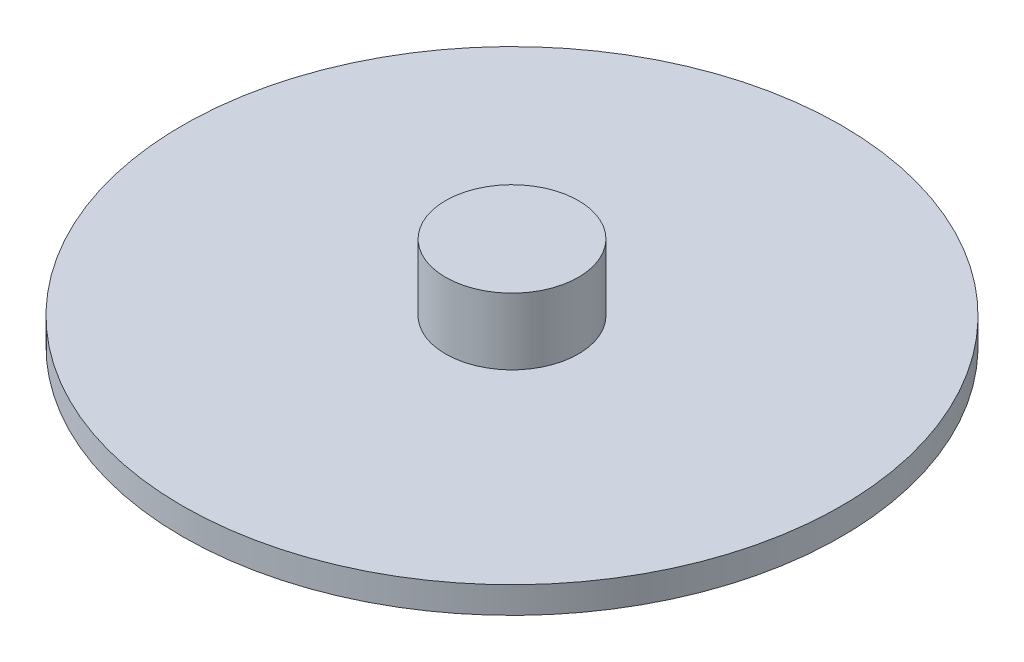
ISO-10303-21;
HEADER;
FILE_DESCRIPTION(('STEP AP214'),'2;1');
FILE_NAME('part.step','',(''),(''),'','','');
FILE_SCHEMA(('AUTOMOTIVE_DESIGN { 1 0 10303 214 1 1 1 1 }'));
ENDSEC;
DATA;
#1=APPLICATION_CONTEXT('core data for automotive mechanical design processes');
#2=APPLICATION_PROTOCOL_DEFINITION('international standard','automotive_design',2000,#1);
#3=PRODUCT_CONTEXT('',#1,'mechanical');
#4=PRODUCT('Part','Part','',(#3));
#5=PRODUCT_RELATED_PRODUCT_CATEGORY('part','',(#4));
#6=PRODUCT_DEFINITION_FORMATION('','',#4);
#7=PRODUCT_DEFINITION_CONTEXT('part definition',#1,'design');
#8=PRODUCT_DEFINITION('design','',#6,#7);
#9=PRODUCT_DEFINITION_SHAPE('','',#8);
#10=(LENGTH_UNIT() NAMED_UNIT(*) SI_UNIT(.MILLI.,.METRE.));
#11=(NAMED_UNIT(*) PLANE_ANGLE_UNIT() SI_UNIT($,.RADIAN.));
#12=(NAMED_UNIT(*) SI_UNIT($,.STERADIAN.) SOLID_ANGLE_UNIT());
#13=UNCERTAINTY_MEASURE_WITH_UNIT(LENGTH_MEASURE(1.E-05),#10,'distance_accuracy_value','');
#14=(GEOMETRIC_REPRESENTATION_CONTEXT(3) GLOBAL_UNCERTAINTY_ASSIGNED_CONTEXT((#13)) GLOBAL_UNIT_ASSIGNED_CONTEXT((#10,
#11,#12)) REPRESENTATION_CONTEXT('',''));
#15=CARTESIAN_POINT('',(0.,0.,0.));
#16=DIRECTION('',(0.,0.,1.));
#17=DIRECTION('',(1.,0.,0.));
#18=AXIS2_PLACEMENT_3D('',#15,#16,#17);
#19=CARTESIAN_POINT('',(0.,2.54,0.));
#20=DIRECTION('',(0.,-1.,0.));
#21=DIRECTION('',(0.,0.,-1.));
#22=AXIS2_PLACEMENT_3D('',#19,#20,#21);
#23=CYLINDRICAL_SURFACE('',#22,31.496);
#24=CARTESIAN_POINT('',(0.,2.54,0.));
#25=DIRECTION('',(0.,1.,0.));
#26=DIRECTION('',(0.,0.,1.));
#27=AXIS2_PLACEMENT_3D('',#24,#25,#26);
#28=CIRCLE('',#27,31.496);
#29=CARTESIAN_POINT('',(0.,2.54,31.496));
#30=VERTEX_POINT('',#29);
#31=EDGE_CURVE('E38',#30,#30,#28,.T.);
#32=ORIENTED_EDGE('',*,*,#31,.F.);
#33=EDGE_LOOP('',(#32));
#34=FACE_BOUND('',#33,.T.);
#35=CARTESIAN_POINT('',(0.,0.,0.));
#36=DIRECTION('',(0.,1.,0.));
#37=DIRECTION('',(0.,0.,1.));
#38=AXIS2_PLACEMENT_3D('',#35,#36,#37);
#39=CIRCLE('',#38,31.496);
#40=CARTESIAN_POINT('',(0.,0.,31.496));
#41=VERTEX_POINT('',#40);
#42=EDGE_CURVE('E34',#41,#41,#39,.T.);
#43=ORIENTED_EDGE('',*,*,#42,.T.);
#44=EDGE_LOOP('',(#43));
#45=FACE_BOUND('',#44,.T.);
#46=ADVANCED_FACE('F31',(#34,#45),#23,.T.);
#47=CARTESIAN_POINT('',(0.,2.54,0.));
#48=DIRECTION('',(0.,1.,0.));
#49=DIRECTION('',(0.,0.,1.));
#50=AXIS2_PLACEMENT_3D('',#47,#48,#49);
#51=PLANE('',#50);
#52=CARTESIAN_POINT('',(0.,2.54,0.));
#53=DIRECTION('',(0.,1.,0.));
#54=DIRECTION('',(0.,0.,1.));
#55=AXIS2_PLACEMENT_3D('',#52,#53,#54);
#56=CIRCLE('',#55,6.35);
#57=CARTESIAN_POINT('',(0.,2.54,6.35));
#58=VERTEX_POINT('',#57);
#59=EDGE_CURVE('E10',#58,#58,#56,.T.);
#60=ORIENTED_EDGE('',*,*,#59,.F.);
#61=EDGE_LOOP('',(#60));
#62=FACE_BOUND('',#61,.T.);
#63=ORIENTED_EDGE('',*,*,#31,.T.);
#64=EDGE_LOOP('',(#63));
#65=FACE_BOUND('',#64,.T.);
#66=ADVANCED_FACE('F55',(#62,#65),#51,.T.);
#67=CARTESIAN_POINT('',(0.,0.,0.));
#68=DIRECTION('',(0.,1.,0.));
#69=DIRECTION('',(0.,0.,1.));
#70=AXIS2_PLACEMENT_3D('',#67,#68,#69);
#71=PLANE('',#70);
#72=ORIENTED_EDGE('',*,*,#42,.F.);
#73=EDGE_LOOP('',(#72));
#74=FACE_BOUND('',#73,.T.);
#75=ADVANCED_FACE('F52',(#74),#71,.F.);
#76=CARTESIAN_POINT('',(0.,8.89,0.));
#77=DIRECTION('',(0.,-1.,0.));
#78=DIRECTION('',(0.,0.,-1.));
#79=AXIS2_PLACEMENT_3D('',#76,#77,#78);
#80=CYLINDRICAL_SURFACE('',#79,6.35);
#81=CARTESIAN_POINT('',(0.,8.89,0.));
#82=DIRECTION('',(0.,1.,0.));
#83=DIRECTION('',(0.,0.,1.));
#84=AXIS2_PLACEMENT_3D('',#81,#82,#83);
#85=CIRCLE('',#84,6.35);
#86=CARTESIAN_POINT('',(0.,8.89,6.35));
#87=VERTEX_POINT('',#86);
#88=EDGE_CURVE('E44',#87,#87,#85,.T.);
#89=ORIENTED_EDGE('',*,*,#88,.F.);
#90=EDGE_LOOP('',(#89));
#91=FACE_BOUND('',#90,.T.);
#92=ORIENTED_EDGE('',*,*,#59,.T.);
#93=EDGE_LOOP('',(#92));
#94=FACE_BOUND('',#93,.T.);
#95=ADVANCED_FACE('F54',(#91,#94),#80,.T.);
#96=CARTESIAN_POINT('',(0.,8.89,0.));
#97=DIRECTION('',(0.,1.,0.));
#98=DIRECTION('',(0.,0.,1.));
#99=AXIS2_PLACEMENT_3D('',#96,#97,#98);
#100=PLANE('',#99);
#101=ORIENTED_EDGE('',*,*,#88,.T.);
#102=EDGE_LOOP('',(#101));
#103=FACE_BOUND('',#102,.T.);
#104=ADVANCED_FACE('F60',(#103),#100,.T.);
#105=CLOSED_SHELL('',(#46,#66,#75,#95,#104));
#106=MANIFOLD_SOLID_BREP('B2',#105);
#107=ADVANCED_BREP_SHAPE_REPRESENTATION('',(#18,#106),#14);
#108=SHAPE_DEFINITION_REPRESENTATION(#9,#107);
ENDSEC;
END-ISO-10303-21;
